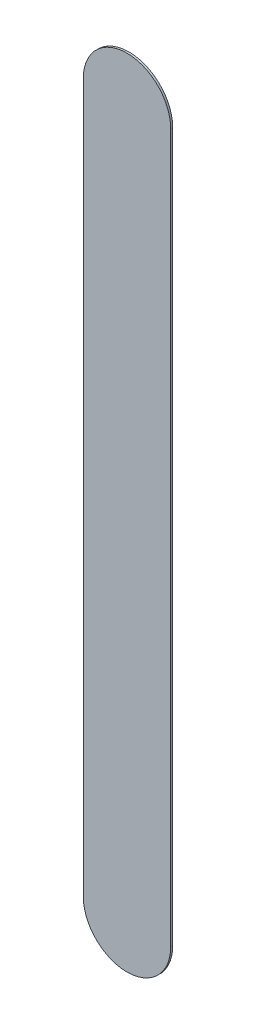
ISO-10303-21;
HEADER;
FILE_DESCRIPTION(('STEP AP214'),'2;1');
FILE_NAME('part.step','',(''),(''),'','','');
FILE_SCHEMA(('AUTOMOTIVE_DESIGN { 1 0 10303 214 1 1 1 1 }'));
ENDSEC;
DATA;
#1=APPLICATION_CONTEXT('core data for automotive mechanical design processes');
#2=APPLICATION_PROTOCOL_DEFINITION('international standard','automotive_design',2000,#1);
#3=PRODUCT_CONTEXT('',#1,'mechanical');
#4=PRODUCT('Part','Part','',(#3));
#5=PRODUCT_RELATED_PRODUCT_CATEGORY('part','',(#4));
#6=PRODUCT_DEFINITION_FORMATION('','',#4);
#7=PRODUCT_DEFINITION_CONTEXT('part definition',#1,'design');
#8=PRODUCT_DEFINITION('design','',#6,#7);
#9=PRODUCT_DEFINITION_SHAPE('','',#8);
#10=(LENGTH_UNIT() NAMED_UNIT(*) SI_UNIT(.MILLI.,.METRE.));
#11=(NAMED_UNIT(*) PLANE_ANGLE_UNIT() SI_UNIT($,.RADIAN.));
#12=(NAMED_UNIT(*) SI_UNIT($,.STERADIAN.) SOLID_ANGLE_UNIT());
#13=UNCERTAINTY_MEASURE_WITH_UNIT(LENGTH_MEASURE(1.E-05),#10,'distance_accuracy_value','');
#14=(GEOMETRIC_REPRESENTATION_CONTEXT(3) GLOBAL_UNCERTAINTY_ASSIGNED_CONTEXT((#13)) GLOBAL_UNIT_ASSIGNED_CONTEXT((#10,
#11,#12)) REPRESENTATION_CONTEXT('',''));
#15=CARTESIAN_POINT('',(0.,0.,0.));
#16=DIRECTION('',(0.,0.,1.));
#17=DIRECTION('',(1.,0.,0.));
#18=AXIS2_PLACEMENT_3D('',#15,#16,#17);
#19=CARTESIAN_POINT('',(120.154,-129.032,0.));
#20=DIRECTION('',(0.,0.,1.));
#21=DIRECTION('',(1.,0.,0.));
#22=AXIS2_PLACEMENT_3D('',#19,#20,#21);
#23=PLANE('',#22);
#24=DIRECTION('',(0.,-1.,0.));
#25=VECTOR('',#24,1.);
#26=CARTESIAN_POINT('',(120.154,-129.032,0.));
#27=LINE('',#26,#25);
#28=CARTESIAN_POINT('',(120.154,-129.032,0.));
#29=VERTEX_POINT('',#28);
#30=CARTESIAN_POINT('',(120.154,-141.184,0.));
#31=VERTEX_POINT('',#30);
#32=EDGE_CURVE('E81',#29,#31,#27,.T.);
#33=ORIENTED_EDGE('',*,*,#32,.T.);
#34=CARTESIAN_POINT('',(120.904,-141.184,0.));
#35=DIRECTION('',(0.,0.,1.));
#36=DIRECTION('',(-1.,0.,0.));
#37=AXIS2_PLACEMENT_3D('',#34,#35,#36);
#38=CIRCLE('',#37,0.75);
#39=CARTESIAN_POINT('',(121.654,-141.184,0.));
#40=VERTEX_POINT('',#39);
#41=EDGE_CURVE('E108',#31,#40,#38,.T.);
#42=ORIENTED_EDGE('',*,*,#41,.T.);
#43=DIRECTION('',(0.,1.,0.));
#44=VECTOR('',#43,1.);
#45=CARTESIAN_POINT('',(121.654,-141.184,0.));
#46=LINE('',#45,#44);
#47=CARTESIAN_POINT('',(121.654,-129.032,0.));
#48=VERTEX_POINT('',#47);
#49=EDGE_CURVE('E74',#40,#48,#46,.T.);
#50=ORIENTED_EDGE('',*,*,#49,.T.);
#51=CARTESIAN_POINT('',(120.904,-129.032,0.));
#52=DIRECTION('',(0.,0.,1.));
#53=DIRECTION('',(1.,0.,0.));
#54=AXIS2_PLACEMENT_3D('',#51,#52,#53);
#55=CIRCLE('',#54,0.75);
#56=EDGE_CURVE('E11',#48,#29,#55,.T.);
#57=ORIENTED_EDGE('',*,*,#56,.T.);
#58=EDGE_LOOP('',(#33,#42,#50,#57));
#59=FACE_BOUND('',#58,.T.);
#60=ADVANCED_FACE('F17',(#59),#23,.T.);
#61=CARTESIAN_POINT('',(120.154,-129.032,-0.035));
#62=DIRECTION('',(0.,0.,1.));
#63=DIRECTION('',(1.,0.,0.));
#64=AXIS2_PLACEMENT_3D('',#61,#62,#63);
#65=PLANE('',#64);
#66=CARTESIAN_POINT('',(120.904,-129.032,-0.035));
#67=DIRECTION('',(0.,0.,1.));
#68=DIRECTION('',(1.,0.,0.));
#69=AXIS2_PLACEMENT_3D('',#66,#67,#68);
#70=CIRCLE('',#69,0.75);
#71=CARTESIAN_POINT('',(121.654,-129.032,-0.035));
#72=VERTEX_POINT('',#71);
#73=CARTESIAN_POINT('',(120.154,-129.032,-0.035));
#74=VERTEX_POINT('',#73);
#75=EDGE_CURVE('E20',#72,#74,#70,.T.);
#76=ORIENTED_EDGE('',*,*,#75,.F.);
#77=DIRECTION('',(0.,1.,0.));
#78=VECTOR('',#77,1.);
#79=CARTESIAN_POINT('',(121.654,-141.184,-0.035));
#80=LINE('',#79,#78);
#81=CARTESIAN_POINT('',(121.654,-141.184,-0.035));
#82=VERTEX_POINT('',#81);
#83=EDGE_CURVE('E98',#82,#72,#80,.T.);
#84=ORIENTED_EDGE('',*,*,#83,.F.);
#85=CARTESIAN_POINT('',(120.904,-141.184,-0.035));
#86=DIRECTION('',(0.,0.,1.));
#87=DIRECTION('',(-1.,0.,0.));
#88=AXIS2_PLACEMENT_3D('',#85,#86,#87);
#89=CIRCLE('',#88,0.75);
#90=CARTESIAN_POINT('',(120.154,-141.184,-0.035));
#91=VERTEX_POINT('',#90);
#92=EDGE_CURVE('E83',#91,#82,#89,.T.);
#93=ORIENTED_EDGE('',*,*,#92,.F.);
#94=DIRECTION('',(0.,-1.,0.));
#95=VECTOR('',#94,1.);
#96=CARTESIAN_POINT('',(120.154,-129.032,-0.035));
#97=LINE('',#96,#95);
#98=EDGE_CURVE('E79',#74,#91,#97,.T.);
#99=ORIENTED_EDGE('',*,*,#98,.F.);
#100=EDGE_LOOP('',(#76,#84,#93,#99));
#101=FACE_BOUND('',#100,.T.);
#102=ADVANCED_FACE('F85',(#101),#65,.F.);
#103=CARTESIAN_POINT('',(120.904,-129.032,-0.035));
#104=DIRECTION('',(0.,0.,-1.));
#105=DIRECTION('',(1.,0.,0.));
#106=AXIS2_PLACEMENT_3D('',#103,#104,#105);
#107=CYLINDRICAL_SURFACE('',#106,0.75);
#108=ORIENTED_EDGE('',*,*,#75,.T.);
#109=DIRECTION('',(0.,0.,1.));
#110=VECTOR('',#109,1.);
#111=CARTESIAN_POINT('',(120.154,-129.032,-0.035));
#112=LINE('',#111,#110);
#113=EDGE_CURVE('E68',#74,#29,#112,.T.);
#114=ORIENTED_EDGE('',*,*,#113,.T.);
#115=ORIENTED_EDGE('',*,*,#56,.F.);
#116=DIRECTION('',(0.,0.,1.));
#117=VECTOR('',#116,1.);
#118=CARTESIAN_POINT('',(121.654,-129.032,-0.035));
#119=LINE('',#118,#117);
#120=EDGE_CURVE('E71',#72,#48,#119,.T.);
#121=ORIENTED_EDGE('',*,*,#120,.F.);
#122=EDGE_LOOP('',(#108,#114,#115,#121));
#123=FACE_BOUND('',#122,.T.);
#124=ADVANCED_FACE('F67',(#123),#107,.T.);
#125=CARTESIAN_POINT('',(121.654,-141.184,-0.035));
#126=DIRECTION('',(-1.,0.,0.));
#127=DIRECTION('',(0.,0.,1.));
#128=AXIS2_PLACEMENT_3D('',#125,#126,#127);
#129=PLANE('',#128);
#130=ORIENTED_EDGE('',*,*,#83,.T.);
#131=ORIENTED_EDGE('',*,*,#120,.T.);
#132=ORIENTED_EDGE('',*,*,#49,.F.);
#133=DIRECTION('',(0.,0.,1.));
#134=VECTOR('',#133,1.);
#135=CARTESIAN_POINT('',(121.654,-141.184,-0.035));
#136=LINE('',#135,#134);
#137=EDGE_CURVE('E104',#82,#40,#136,.T.);
#138=ORIENTED_EDGE('',*,*,#137,.F.);
#139=EDGE_LOOP('',(#130,#131,#132,#138));
#140=FACE_BOUND('',#139,.T.);
#141=ADVANCED_FACE('F122',(#140),#129,.F.);
#142=CARTESIAN_POINT('',(120.904,-141.184,-0.035));
#143=DIRECTION('',(0.,0.,-1.));
#144=DIRECTION('',(-1.,0.,0.));
#145=AXIS2_PLACEMENT_3D('',#142,#143,#144);
#146=CYLINDRICAL_SURFACE('',#145,0.75);
#147=ORIENTED_EDGE('',*,*,#92,.T.);
#148=ORIENTED_EDGE('',*,*,#137,.T.);
#149=ORIENTED_EDGE('',*,*,#41,.F.);
#150=DIRECTION('',(0.,0.,1.));
#151=VECTOR('',#150,1.);
#152=CARTESIAN_POINT('',(120.154,-141.184,-0.035));
#153=LINE('',#152,#151);
#154=EDGE_CURVE('E89',#91,#31,#153,.T.);
#155=ORIENTED_EDGE('',*,*,#154,.F.);
#156=EDGE_LOOP('',(#147,#148,#149,#155));
#157=FACE_BOUND('',#156,.T.);
#158=ADVANCED_FACE('F120',(#157),#146,.T.);
#159=CARTESIAN_POINT('',(120.154,-129.032,-0.035));
#160=DIRECTION('',(1.,0.,0.));
#161=DIRECTION('',(0.,1.,0.));
#162=AXIS2_PLACEMENT_3D('',#159,#160,#161);
#163=PLANE('',#162);
#164=ORIENTED_EDGE('',*,*,#98,.T.);
#165=ORIENTED_EDGE('',*,*,#154,.T.);
#166=ORIENTED_EDGE('',*,*,#32,.F.);
#167=ORIENTED_EDGE('',*,*,#113,.F.);
#168=EDGE_LOOP('',(#164,#165,#166,#167));
#169=FACE_BOUND('',#168,.T.);
#170=ADVANCED_FACE('F77',(#169),#163,.F.);
#171=CLOSED_SHELL('',(#60,#102,#124,#141,#158,#170));
#172=MANIFOLD_SOLID_BREP('B1',#171);
#173=ADVANCED_BREP_SHAPE_REPRESENTATION('',(#18,#172),#14);
#174=SHAPE_DEFINITION_REPRESENTATION(#9,#173);
ENDSEC;
END-ISO-10303-21;
